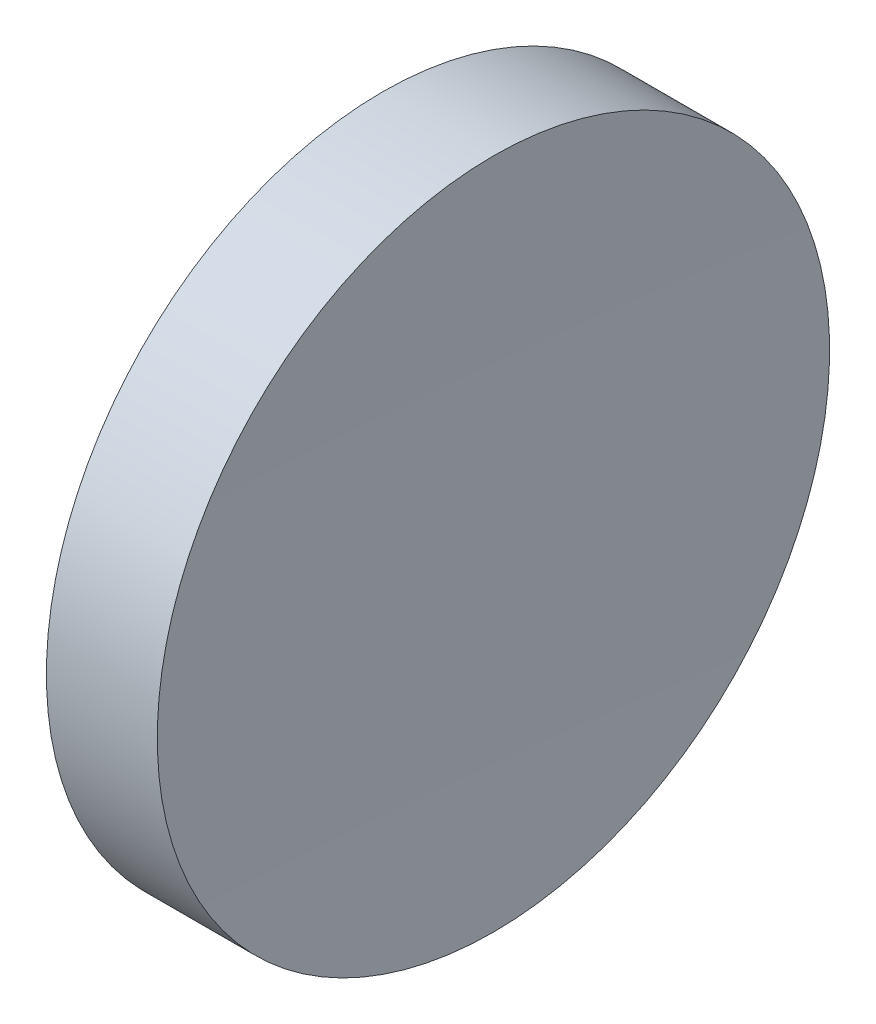
ISO-10303-21;
HEADER;
FILE_DESCRIPTION(('STEP AP214'),'2;1');
FILE_NAME('part.step','',(''),(''),'','','');
FILE_SCHEMA(('AUTOMOTIVE_DESIGN { 1 0 10303 214 1 1 1 1 }'));
ENDSEC;
DATA;
#1=APPLICATION_CONTEXT('core data for automotive mechanical design processes');
#2=APPLICATION_PROTOCOL_DEFINITION('international standard','automotive_design',2000,#1);
#3=PRODUCT_CONTEXT('',#1,'mechanical');
#4=PRODUCT('Part','Part','',(#3));
#5=PRODUCT_RELATED_PRODUCT_CATEGORY('part','',(#4));
#6=PRODUCT_DEFINITION_FORMATION('','',#4);
#7=PRODUCT_DEFINITION_CONTEXT('part definition',#1,'design');
#8=PRODUCT_DEFINITION('design','',#6,#7);
#9=PRODUCT_DEFINITION_SHAPE('','',#8);
#10=(LENGTH_UNIT() NAMED_UNIT(*) SI_UNIT(.MILLI.,.METRE.));
#11=(NAMED_UNIT(*) PLANE_ANGLE_UNIT() SI_UNIT($,.RADIAN.));
#12=(NAMED_UNIT(*) SI_UNIT($,.STERADIAN.) SOLID_ANGLE_UNIT());
#13=UNCERTAINTY_MEASURE_WITH_UNIT(LENGTH_MEASURE(1.E-05),#10,'distance_accuracy_value','');
#14=(GEOMETRIC_REPRESENTATION_CONTEXT(3) GLOBAL_UNCERTAINTY_ASSIGNED_CONTEXT((#13)) GLOBAL_UNIT_ASSIGNED_CONTEXT((#10,
#11,#12)) REPRESENTATION_CONTEXT('',''));
#15=CARTESIAN_POINT('',(0.,0.,0.));
#16=DIRECTION('',(0.,0.,1.));
#17=DIRECTION('',(1.,0.,0.));
#18=AXIS2_PLACEMENT_3D('',#15,#16,#17);
#19=CARTESIAN_POINT('',(150.273910621317,32.6084202354702,0.));
#20=DIRECTION('',(-1.,0.,0.));
#21=DIRECTION('',(0.,1.,0.));
#22=AXIS2_PLACEMENT_3D('',#19,#20,#21);
#23=SPHERICAL_SURFACE('',#22,89.);
#24=CARTESIAN_POINT('',(61.4936340955032,32.6084202354702,0.));
#25=DIRECTION('',(-1.,0.,0.));
#26=DIRECTION('',(0.,-1.,0.));
#27=AXIS2_PLACEMENT_3D('',#24,#25,#26);
#28=CIRCLE('',#27,6.24999999999998);
#29=CARTESIAN_POINT('',(61.4936340955032,26.3584202354702,0.));
#30=VERTEX_POINT('',#29);
#31=EDGE_CURVE('E41',#30,#30,#28,.T.);
#32=ORIENTED_EDGE('',*,*,#31,.T.);
#33=EDGE_LOOP('',(#32));
#34=FACE_BOUND('',#33,.T.);
#35=ADVANCED_FACE('F35',(#34),#23,.T.);
#36=CARTESIAN_POINT('',(303.473910621317,32.6084202354702,0.));
#37=DIRECTION('',(-1.,0.,0.));
#38=DIRECTION('',(0.,1.,0.));
#39=AXIS2_PLACEMENT_3D('',#36,#37,#38);
#40=SPHERICAL_SURFACE('',#39,240.);
#41=CARTESIAN_POINT('',(63.5553046317024,32.6084202354702,0.));
#42=DIRECTION('',(-1.,0.,0.));
#43=DIRECTION('',(0.,-1.,0.));
#44=AXIS2_PLACEMENT_3D('',#41,#42,#43);
#45=CIRCLE('',#44,6.24999999999997);
#46=CARTESIAN_POINT('',(63.5553046317024,26.3584202354702,0.));
#47=VERTEX_POINT('',#46);
#48=EDGE_CURVE('E10',#47,#47,#45,.T.);
#49=ORIENTED_EDGE('',*,*,#48,.F.);
#50=EDGE_LOOP('',(#49));
#51=FACE_BOUND('',#50,.T.);
#52=ADVANCED_FACE('F50',(#51),#40,.F.);
#53=CARTESIAN_POINT('',(57.9722456489816,32.6084202354702,0.));
#54=DIRECTION('',(-1.,0.,0.));
#55=DIRECTION('',(0.,-1.,0.));
#56=AXIS2_PLACEMENT_3D('',#53,#54,#55);
#57=CYLINDRICAL_SURFACE('',#56,6.24999999999998);
#58=ORIENTED_EDGE('',*,*,#31,.F.);
#59=EDGE_LOOP('',(#58));
#60=FACE_BOUND('',#59,.T.);
#61=ORIENTED_EDGE('',*,*,#48,.T.);
#62=EDGE_LOOP('',(#61));
#63=FACE_BOUND('',#62,.T.);
#64=ADVANCED_FACE('F48',(#60,#63),#57,.T.);
#65=CLOSED_SHELL('',(#35,#52,#64));
#66=MANIFOLD_SOLID_BREP('B2',#65);
#67=ADVANCED_BREP_SHAPE_REPRESENTATION('',(#18,#66),#14);
#68=SHAPE_DEFINITION_REPRESENTATION(#9,#67);
ENDSEC;
END-ISO-10303-21;
